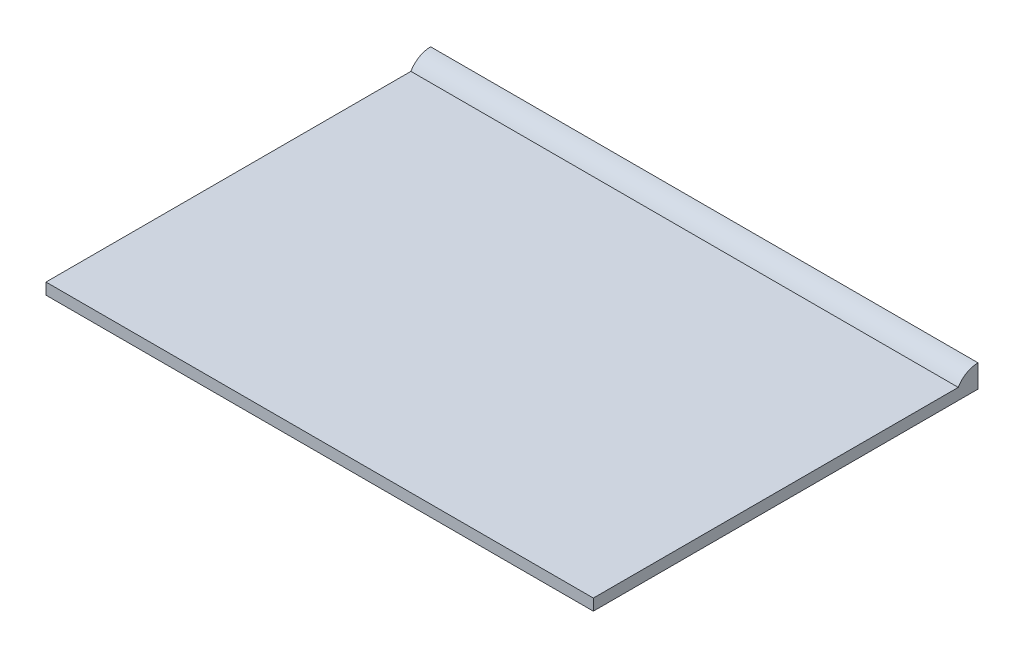
ISO-10303-21;
HEADER;
FILE_DESCRIPTION(('STEP AP214'),'2;1');
FILE_NAME('part.step','',(''),(''),'','','');
FILE_SCHEMA(('AUTOMOTIVE_DESIGN { 1 0 10303 214 1 1 1 1 }'));
ENDSEC;
DATA;
#1=APPLICATION_CONTEXT('core data for automotive mechanical design processes');
#2=APPLICATION_PROTOCOL_DEFINITION('international standard','automotive_design',2000,#1);
#3=PRODUCT_CONTEXT('',#1,'mechanical');
#4=PRODUCT('Part','Part','',(#3));
#5=PRODUCT_RELATED_PRODUCT_CATEGORY('part','',(#4));
#6=PRODUCT_DEFINITION_FORMATION('','',#4);
#7=PRODUCT_DEFINITION_CONTEXT('part definition',#1,'design');
#8=PRODUCT_DEFINITION('design','',#6,#7);
#9=PRODUCT_DEFINITION_SHAPE('','',#8);
#10=(LENGTH_UNIT() NAMED_UNIT(*) SI_UNIT(.MILLI.,.METRE.));
#11=(NAMED_UNIT(*) PLANE_ANGLE_UNIT() SI_UNIT($,.RADIAN.));
#12=(NAMED_UNIT(*) SI_UNIT($,.STERADIAN.) SOLID_ANGLE_UNIT());
#13=UNCERTAINTY_MEASURE_WITH_UNIT(LENGTH_MEASURE(1.E-05),#10,'distance_accuracy_value','');
#14=(GEOMETRIC_REPRESENTATION_CONTEXT(3) GLOBAL_UNCERTAINTY_ASSIGNED_CONTEXT((#13)) GLOBAL_UNIT_ASSIGNED_CONTEXT((#10,
#11,#12)) REPRESENTATION_CONTEXT('',''));
#15=CARTESIAN_POINT('',(0.,0.,0.));
#16=DIRECTION('',(0.,0.,1.));
#17=DIRECTION('',(1.,0.,0.));
#18=AXIS2_PLACEMENT_3D('',#15,#16,#17);
#19=CARTESIAN_POINT('',(-2.24506403026729,0.396875,-13.3874076642539));
#20=DIRECTION('',(1.,0.,0.));
#21=DIRECTION('',(0.,0.,-1.));
#22=AXIS2_PLACEMENT_3D('',#19,#20,#21);
#23=CYLINDRICAL_SURFACE('',#22,0.793749999999999);
#24=CARTESIAN_POINT('',(19.05,0.396875,-13.3874076642539));
#25=DIRECTION('',(1.,0.,0.));
#26=DIRECTION('',(0.,0.,-1.));
#27=AXIS2_PLACEMENT_3D('',#24,#25,#26);
#28=CIRCLE('',#27,0.793749999999999);
#29=CARTESIAN_POINT('',(19.05,1.190625,-13.3874076642539));
#30=VERTEX_POINT('',#29);
#31=CARTESIAN_POINT('',(19.05,0.79375,-12.7));
#32=VERTEX_POINT('',#31);
#33=EDGE_CURVE('E117',#30,#32,#28,.T.);
#34=ORIENTED_EDGE('',*,*,#33,.F.);
#35=DIRECTION('',(1.,0.,0.));
#36=VECTOR('',#35,1.);
#37=CARTESIAN_POINT('',(0.,1.190625,-13.3874076642539));
#38=LINE('',#37,#36);
#39=CARTESIAN_POINT('',(0.,1.190625,-13.3874076642539));
#40=VERTEX_POINT('',#39);
#41=EDGE_CURVE('E95',#40,#30,#38,.T.);
#42=ORIENTED_EDGE('',*,*,#41,.F.);
#43=CARTESIAN_POINT('',(0.,0.396875,-13.3874076642539));
#44=DIRECTION('',(1.,0.,0.));
#45=DIRECTION('',(0.,0.,-1.));
#46=AXIS2_PLACEMENT_3D('',#43,#44,#45);
#47=CIRCLE('',#46,0.793749999999999);
#48=CARTESIAN_POINT('',(0.,0.79375,-12.7));
#49=VERTEX_POINT('',#48);
#50=EDGE_CURVE('E107',#49,#40,#47,.F.);
#51=ORIENTED_EDGE('',*,*,#50,.F.);
#52=DIRECTION('',(-1.,0.,0.));
#53=VECTOR('',#52,1.);
#54=CARTESIAN_POINT('',(0.,0.79375,-12.7));
#55=LINE('',#54,#53);
#56=EDGE_CURVE('E62',#32,#49,#55,.T.);
#57=ORIENTED_EDGE('',*,*,#56,.F.);
#58=EDGE_LOOP('',(#34,#42,#51,#57));
#59=FACE_BOUND('',#58,.T.);
#60=ADVANCED_FACE('F38',(#59),#23,.T.);
#61=CARTESIAN_POINT('',(0.,0.79375,0.));
#62=DIRECTION('',(1.,0.,0.));
#63=DIRECTION('',(0.,0.,-1.));
#64=AXIS2_PLACEMENT_3D('',#61,#62,#63);
#65=PLANE('',#64);
#66=DIRECTION('',(0.,-1.,0.));
#67=VECTOR('',#66,1.);
#68=CARTESIAN_POINT('',(0.,0.396875,-13.3874076642539));
#69=LINE('',#68,#67);
#70=CARTESIAN_POINT('',(0.,0.396875,-13.3874076642539));
#71=VERTEX_POINT('',#70);
#72=EDGE_CURVE('E54',#40,#71,#69,.T.);
#73=ORIENTED_EDGE('',*,*,#72,.T.);
#74=DIRECTION('',(0.,0.,1.));
#75=VECTOR('',#74,1.);
#76=CARTESIAN_POINT('',(0.,0.396875,0.));
#77=LINE('',#76,#75);
#78=CARTESIAN_POINT('',(0.,0.396875,0.));
#79=VERTEX_POINT('',#78);
#80=EDGE_CURVE('E98',#71,#79,#77,.T.);
#81=ORIENTED_EDGE('',*,*,#80,.T.);
#82=DIRECTION('',(0.,-1.,0.));
#83=VECTOR('',#82,1.);
#84=CARTESIAN_POINT('',(0.,0.79375,0.));
#85=LINE('',#84,#83);
#86=CARTESIAN_POINT('',(0.,0.79375,0.));
#87=VERTEX_POINT('',#86);
#88=EDGE_CURVE('E11',#87,#79,#85,.T.);
#89=ORIENTED_EDGE('',*,*,#88,.F.);
#90=DIRECTION('',(0.,0.,1.));
#91=VECTOR('',#90,1.);
#92=CARTESIAN_POINT('',(0.,0.79375,0.));
#93=LINE('',#92,#91);
#94=EDGE_CURVE('E125',#49,#87,#93,.T.);
#95=ORIENTED_EDGE('',*,*,#94,.F.);
#96=ORIENTED_EDGE('',*,*,#50,.T.);
#97=EDGE_LOOP('',(#73,#81,#89,#95,#96));
#98=FACE_BOUND('',#97,.T.);
#99=ADVANCED_FACE('F40',(#98),#65,.F.);
#100=CARTESIAN_POINT('',(0.,0.79375,0.));
#101=DIRECTION('',(0.,0.,-1.));
#102=DIRECTION('',(-1.,0.,0.));
#103=AXIS2_PLACEMENT_3D('',#100,#101,#102);
#104=PLANE('',#103);
#105=ORIENTED_EDGE('',*,*,#88,.T.);
#106=DIRECTION('',(1.,0.,0.));
#107=VECTOR('',#106,1.);
#108=CARTESIAN_POINT('',(0.,0.396875,0.));
#109=LINE('',#108,#107);
#110=CARTESIAN_POINT('',(19.05,0.396875,0.));
#111=VERTEX_POINT('',#110);
#112=EDGE_CURVE('E94',#79,#111,#109,.T.);
#113=ORIENTED_EDGE('',*,*,#112,.T.);
#114=DIRECTION('',(0.,-1.,0.));
#115=VECTOR('',#114,1.);
#116=CARTESIAN_POINT('',(19.05,0.79375,0.));
#117=LINE('',#116,#115);
#118=CARTESIAN_POINT('',(19.05,0.79375,0.));
#119=VERTEX_POINT('',#118);
#120=EDGE_CURVE('E47',#119,#111,#117,.T.);
#121=ORIENTED_EDGE('',*,*,#120,.F.);
#122=DIRECTION('',(1.,0.,0.));
#123=VECTOR('',#122,1.);
#124=CARTESIAN_POINT('',(0.,0.79375,0.));
#125=LINE('',#124,#123);
#126=EDGE_CURVE('E128',#87,#119,#125,.T.);
#127=ORIENTED_EDGE('',*,*,#126,.F.);
#128=EDGE_LOOP('',(#105,#113,#121,#127));
#129=FACE_BOUND('',#128,.T.);
#130=ADVANCED_FACE('F142',(#129),#104,.F.);
#131=CARTESIAN_POINT('',(19.05,0.79375,0.));
#132=DIRECTION('',(-1.,0.,0.));
#133=DIRECTION('',(0.,0.,1.));
#134=AXIS2_PLACEMENT_3D('',#131,#132,#133);
#135=PLANE('',#134);
#136=ORIENTED_EDGE('',*,*,#120,.T.);
#137=DIRECTION('',(0.,0.,1.));
#138=VECTOR('',#137,1.);
#139=CARTESIAN_POINT('',(19.05,0.396875,0.));
#140=LINE('',#139,#138);
#141=CARTESIAN_POINT('',(19.05,0.396875,-13.3874076642539));
#142=VERTEX_POINT('',#141);
#143=EDGE_CURVE('E109',#142,#111,#140,.T.);
#144=ORIENTED_EDGE('',*,*,#143,.F.);
#145=DIRECTION('',(0.,-1.,0.));
#146=VECTOR('',#145,1.);
#147=CARTESIAN_POINT('',(19.05,0.396875,-13.3874076642539));
#148=LINE('',#147,#146);
#149=EDGE_CURVE('E90',#30,#142,#148,.T.);
#150=ORIENTED_EDGE('',*,*,#149,.F.);
#151=ORIENTED_EDGE('',*,*,#33,.T.);
#152=DIRECTION('',(0.,0.,-1.));
#153=VECTOR('',#152,1.);
#154=CARTESIAN_POINT('',(19.05,0.79375,0.));
#155=LINE('',#154,#153);
#156=EDGE_CURVE('E131',#119,#32,#155,.T.);
#157=ORIENTED_EDGE('',*,*,#156,.F.);
#158=EDGE_LOOP('',(#136,#144,#150,#151,#157));
#159=FACE_BOUND('',#158,.T.);
#160=ADVANCED_FACE('F140',(#159),#135,.F.);
#161=CARTESIAN_POINT('',(0.,0.79375,0.));
#162=DIRECTION('',(0.,-1.,0.));
#163=DIRECTION('',(0.,0.,-1.));
#164=AXIS2_PLACEMENT_3D('',#161,#162,#163);
#165=PLANE('',#164);
#166=ORIENTED_EDGE('',*,*,#94,.T.);
#167=ORIENTED_EDGE('',*,*,#126,.T.);
#168=ORIENTED_EDGE('',*,*,#156,.T.);
#169=ORIENTED_EDGE('',*,*,#56,.T.);
#170=EDGE_LOOP('',(#166,#167,#168,#169));
#171=FACE_BOUND('',#170,.T.);
#172=ADVANCED_FACE('F145',(#171),#165,.F.);
#173=CARTESIAN_POINT('',(0.,0.396875,0.));
#174=DIRECTION('',(0.,1.,0.));
#175=DIRECTION('',(0.,0.,1.));
#176=AXIS2_PLACEMENT_3D('',#173,#174,#175);
#177=PLANE('',#176);
#178=ORIENTED_EDGE('',*,*,#143,.T.);
#179=ORIENTED_EDGE('',*,*,#112,.F.);
#180=ORIENTED_EDGE('',*,*,#80,.F.);
#181=DIRECTION('',(1.,0.,0.));
#182=VECTOR('',#181,1.);
#183=CARTESIAN_POINT('',(0.,0.396875,-13.3874076642539));
#184=LINE('',#183,#182);
#185=EDGE_CURVE('E86',#71,#142,#184,.T.);
#186=ORIENTED_EDGE('',*,*,#185,.T.);
#187=EDGE_LOOP('',(#178,#179,#180,#186));
#188=FACE_BOUND('',#187,.T.);
#189=ADVANCED_FACE('F99',(#188),#177,.F.);
#190=CARTESIAN_POINT('',(0.,0.396875,-13.3874076642539));
#191=DIRECTION('',(0.,0.,1.));
#192=DIRECTION('',(0.,-1.,0.));
#193=AXIS2_PLACEMENT_3D('',#190,#191,#192);
#194=PLANE('',#193);
#195=ORIENTED_EDGE('',*,*,#149,.T.);
#196=ORIENTED_EDGE('',*,*,#185,.F.);
#197=ORIENTED_EDGE('',*,*,#72,.F.);
#198=ORIENTED_EDGE('',*,*,#41,.T.);
#199=EDGE_LOOP('',(#195,#196,#197,#198));
#200=FACE_BOUND('',#199,.T.);
#201=ADVANCED_FACE('F88',(#200),#194,.F.);
#202=CLOSED_SHELL('',(#60,#99,#130,#160,#172,#189,#201));
#203=MANIFOLD_SOLID_BREP('B2',#202);
#204=ADVANCED_BREP_SHAPE_REPRESENTATION('',(#18,#203),#14);
#205=SHAPE_DEFINITION_REPRESENTATION(#9,#204);
ENDSEC;
END-ISO-10303-21;
